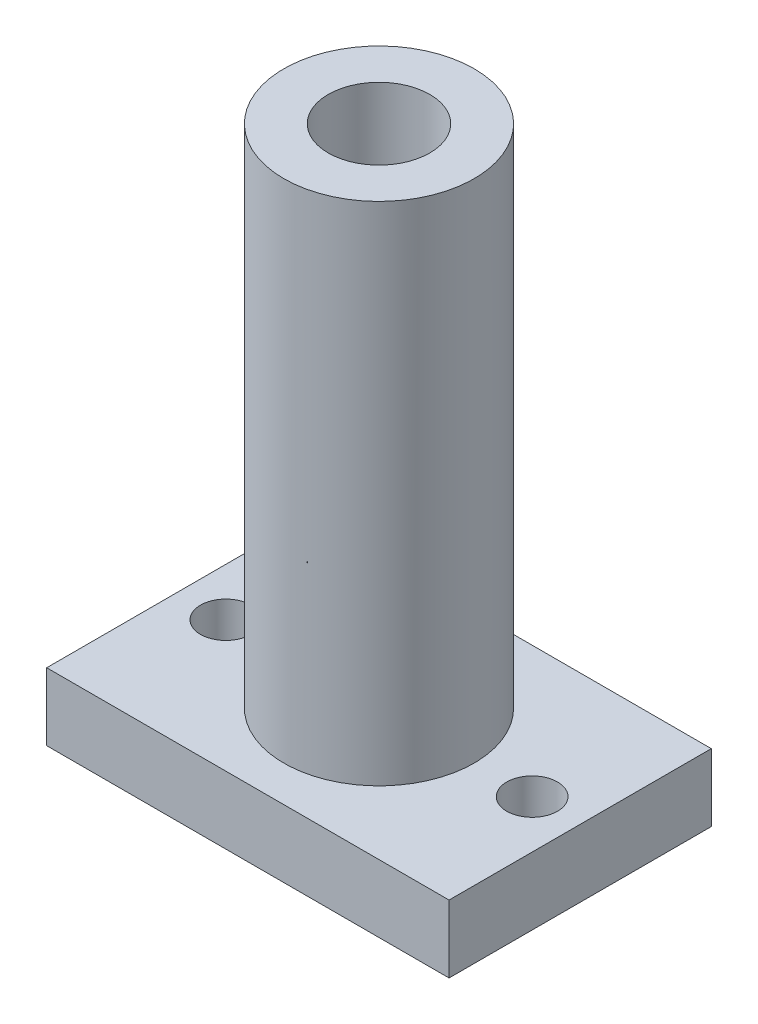
ISO-10303-21;
HEADER;
FILE_DESCRIPTION(('STEP AP214'),'2;1');
FILE_NAME('part.step','',(''),(''),'','','');
FILE_SCHEMA(('AUTOMOTIVE_DESIGN { 1 0 10303 214 1 1 1 1 }'));
ENDSEC;
DATA;
#1=APPLICATION_CONTEXT('core data for automotive mechanical design processes');
#2=APPLICATION_PROTOCOL_DEFINITION('international standard','automotive_design',2000,#1);
#3=PRODUCT_CONTEXT('',#1,'mechanical');
#4=PRODUCT('Part','Part','',(#3));
#5=PRODUCT_RELATED_PRODUCT_CATEGORY('part','',(#4));
#6=PRODUCT_DEFINITION_FORMATION('','',#4);
#7=PRODUCT_DEFINITION_CONTEXT('part definition',#1,'design');
#8=PRODUCT_DEFINITION('design','',#6,#7);
#9=PRODUCT_DEFINITION_SHAPE('','',#8);
#10=(LENGTH_UNIT() NAMED_UNIT(*) SI_UNIT(.MILLI.,.METRE.));
#11=(NAMED_UNIT(*) PLANE_ANGLE_UNIT() SI_UNIT($,.RADIAN.));
#12=(NAMED_UNIT(*) SI_UNIT($,.STERADIAN.) SOLID_ANGLE_UNIT());
#13=UNCERTAINTY_MEASURE_WITH_UNIT(LENGTH_MEASURE(1.E-05),#10,'distance_accuracy_value','');
#14=(GEOMETRIC_REPRESENTATION_CONTEXT(3) GLOBAL_UNCERTAINTY_ASSIGNED_CONTEXT((#13)) GLOBAL_UNIT_ASSIGNED_CONTEXT((#10,
#11,#12)) REPRESENTATION_CONTEXT('',''));
#15=CARTESIAN_POINT('',(0.,0.,0.));
#16=DIRECTION('',(0.,0.,1.));
#17=DIRECTION('',(1.,0.,0.));
#18=AXIS2_PLACEMENT_3D('',#15,#16,#17);
#19=CARTESIAN_POINT('',(0.,5.32,0.));
#20=DIRECTION('',(1.,0.,0.));
#21=DIRECTION('',(0.,0.,-1.));
#22=AXIS2_PLACEMENT_3D('',#19,#20,#21);
#23=PLANE('',#22);
#24=DIRECTION('',(0.,0.,1.));
#25=VECTOR('',#24,1.);
#26=CARTESIAN_POINT('',(0.,0.,0.));
#27=LINE('',#26,#25);
#28=CARTESIAN_POINT('',(0.,0.,-20.66));
#29=VERTEX_POINT('',#28);
#30=CARTESIAN_POINT('',(0.,0.,0.));
#31=VERTEX_POINT('',#30);
#32=EDGE_CURVE('E99',#29,#31,#27,.T.);
#33=ORIENTED_EDGE('',*,*,#32,.T.);
#34=DIRECTION('',(0.,-1.,0.));
#35=VECTOR('',#34,1.);
#36=CARTESIAN_POINT('',(0.,5.32,0.));
#37=LINE('',#36,#35);
#38=CARTESIAN_POINT('',(0.,5.32,0.));
#39=VERTEX_POINT('',#38);
#40=EDGE_CURVE('E41',#39,#31,#37,.T.);
#41=ORIENTED_EDGE('',*,*,#40,.F.);
#42=DIRECTION('',(0.,0.,1.));
#43=VECTOR('',#42,1.);
#44=CARTESIAN_POINT('',(0.,5.32,0.));
#45=LINE('',#44,#43);
#46=CARTESIAN_POINT('',(0.,5.32,-20.66));
#47=VERTEX_POINT('',#46);
#48=EDGE_CURVE('E85',#47,#39,#45,.T.);
#49=ORIENTED_EDGE('',*,*,#48,.F.);
#50=DIRECTION('',(0.,-1.,0.));
#51=VECTOR('',#50,1.);
#52=CARTESIAN_POINT('',(0.,5.32,-20.66));
#53=LINE('',#52,#51);
#54=EDGE_CURVE('E95',#47,#29,#53,.T.);
#55=ORIENTED_EDGE('',*,*,#54,.T.);
#56=EDGE_LOOP('',(#33,#41,#49,#55));
#57=FACE_BOUND('',#56,.T.);
#58=ADVANCED_FACE('F32',(#57),#23,.F.);
#59=CARTESIAN_POINT('',(0.,5.32,0.));
#60=DIRECTION('',(0.,0.,-1.));
#61=DIRECTION('',(-1.,0.,0.));
#62=AXIS2_PLACEMENT_3D('',#59,#60,#61);
#63=PLANE('',#62);
#64=DIRECTION('',(1.,0.,0.));
#65=VECTOR('',#64,1.);
#66=CARTESIAN_POINT('',(0.,0.,0.));
#67=LINE('',#66,#65);
#68=CARTESIAN_POINT('',(31.7,0.,0.));
#69=VERTEX_POINT('',#68);
#70=EDGE_CURVE('E90',#31,#69,#67,.T.);
#71=ORIENTED_EDGE('',*,*,#70,.T.);
#72=DIRECTION('',(0.,-1.,0.));
#73=VECTOR('',#72,1.);
#74=CARTESIAN_POINT('',(31.7,5.32,0.));
#75=LINE('',#74,#73);
#76=CARTESIAN_POINT('',(31.7,5.32,0.));
#77=VERTEX_POINT('',#76);
#78=EDGE_CURVE('E88',#77,#69,#75,.T.);
#79=ORIENTED_EDGE('',*,*,#78,.F.);
#80=DIRECTION('',(1.,0.,0.));
#81=VECTOR('',#80,1.);
#82=CARTESIAN_POINT('',(0.,5.32,0.));
#83=LINE('',#82,#81);
#84=EDGE_CURVE('E80',#39,#77,#83,.T.);
#85=ORIENTED_EDGE('',*,*,#84,.F.);
#86=ORIENTED_EDGE('',*,*,#40,.T.);
#87=EDGE_LOOP('',(#71,#79,#85,#86));
#88=FACE_BOUND('',#87,.T.);
#89=ADVANCED_FACE('F89',(#88),#63,.F.);
#90=CARTESIAN_POINT('',(31.7,5.32,0.));
#91=DIRECTION('',(-1.,0.,0.));
#92=DIRECTION('',(0.,0.,1.));
#93=AXIS2_PLACEMENT_3D('',#90,#91,#92);
#94=PLANE('',#93);
#95=DIRECTION('',(0.,0.,-1.));
#96=VECTOR('',#95,1.);
#97=CARTESIAN_POINT('',(31.7,0.,0.));
#98=LINE('',#97,#96);
#99=CARTESIAN_POINT('',(31.7,0.,-20.66));
#100=VERTEX_POINT('',#99);
#101=EDGE_CURVE('E66',#69,#100,#98,.T.);
#102=ORIENTED_EDGE('',*,*,#101,.T.);
#103=DIRECTION('',(0.,-1.,0.));
#104=VECTOR('',#103,1.);
#105=CARTESIAN_POINT('',(31.7,5.32,-20.66));
#106=LINE('',#105,#104);
#107=CARTESIAN_POINT('',(31.7,5.32,-20.66));
#108=VERTEX_POINT('',#107);
#109=EDGE_CURVE('E91',#108,#100,#106,.T.);
#110=ORIENTED_EDGE('',*,*,#109,.F.);
#111=DIRECTION('',(0.,0.,-1.));
#112=VECTOR('',#111,1.);
#113=CARTESIAN_POINT('',(31.7,5.32,0.));
#114=LINE('',#113,#112);
#115=EDGE_CURVE('E83',#77,#108,#114,.T.);
#116=ORIENTED_EDGE('',*,*,#115,.F.);
#117=ORIENTED_EDGE('',*,*,#78,.T.);
#118=EDGE_LOOP('',(#102,#110,#116,#117));
#119=FACE_BOUND('',#118,.T.);
#120=ADVANCED_FACE('F93',(#119),#94,.F.);
#121=CARTESIAN_POINT('',(0.,5.32,-20.66));
#122=DIRECTION('',(0.,0.,1.));
#123=DIRECTION('',(1.,0.,0.));
#124=AXIS2_PLACEMENT_3D('',#121,#122,#123);
#125=PLANE('',#124);
#126=DIRECTION('',(-1.,0.,0.));
#127=VECTOR('',#126,1.);
#128=CARTESIAN_POINT('',(0.,0.,-20.66));
#129=LINE('',#128,#127);
#130=EDGE_CURVE('E72',#100,#29,#129,.T.);
#131=ORIENTED_EDGE('',*,*,#130,.T.);
#132=ORIENTED_EDGE('',*,*,#54,.F.);
#133=DIRECTION('',(-1.,0.,0.));
#134=VECTOR('',#133,1.);
#135=CARTESIAN_POINT('',(0.,5.32,-20.66));
#136=LINE('',#135,#134);
#137=EDGE_CURVE('E49',#108,#47,#136,.T.);
#138=ORIENTED_EDGE('',*,*,#137,.F.);
#139=ORIENTED_EDGE('',*,*,#109,.T.);
#140=EDGE_LOOP('',(#131,#132,#138,#139));
#141=FACE_BOUND('',#140,.T.);
#142=ADVANCED_FACE('F123',(#141),#125,.F.);
#143=CARTESIAN_POINT('',(0.,5.32,0.));
#144=DIRECTION('',(0.,-1.,0.));
#145=DIRECTION('',(0.,0.,-1.));
#146=AXIS2_PLACEMENT_3D('',#143,#144,#145);
#147=PLANE('',#146);
#148=CARTESIAN_POINT('',(15.85,5.32,-10.33));
#149=DIRECTION('',(0.,-1.,0.));
#150=DIRECTION('',(0.,0.,-1.));
#151=AXIS2_PLACEMENT_3D('',#148,#149,#150);
#152=CIRCLE('',#151,7.5);
#153=CARTESIAN_POINT('',(15.85,5.32,-17.83));
#154=VERTEX_POINT('',#153);
#155=EDGE_CURVE('E11',#154,#154,#152,.F.);
#156=ORIENTED_EDGE('',*,*,#155,.F.);
#157=EDGE_LOOP('',(#156));
#158=FACE_BOUND('',#157,.T.);
#159=CARTESIAN_POINT('',(3.785,5.32,-10.33));
#160=DIRECTION('',(0.,1.,0.));
#161=DIRECTION('',(0.,0.,1.));
#162=AXIS2_PLACEMENT_3D('',#159,#160,#161);
#163=CIRCLE('',#162,2.);
#164=CARTESIAN_POINT('',(3.785,5.32,-8.33));
#165=VERTEX_POINT('',#164);
#166=EDGE_CURVE('E203',#165,#165,#163,.T.);
#167=ORIENTED_EDGE('',*,*,#166,.F.);
#168=EDGE_LOOP('',(#167));
#169=FACE_BOUND('',#168,.T.);
#170=CARTESIAN_POINT('',(27.915,5.32,-10.33));
#171=DIRECTION('',(0.,1.,0.));
#172=DIRECTION('',(0.,0.,1.));
#173=AXIS2_PLACEMENT_3D('',#170,#171,#172);
#174=CIRCLE('',#173,2.);
#175=CARTESIAN_POINT('',(27.915,5.32,-8.33));
#176=VERTEX_POINT('',#175);
#177=EDGE_CURVE('E209',#176,#176,#174,.T.);
#178=ORIENTED_EDGE('',*,*,#177,.F.);
#179=EDGE_LOOP('',(#178));
#180=FACE_BOUND('',#179,.T.);
#181=ORIENTED_EDGE('',*,*,#48,.T.);
#182=ORIENTED_EDGE('',*,*,#84,.T.);
#183=ORIENTED_EDGE('',*,*,#115,.T.);
#184=ORIENTED_EDGE('',*,*,#137,.T.);
#185=EDGE_LOOP('',(#181,#182,#183,#184));
#186=FACE_BOUND('',#185,.T.);
#187=ADVANCED_FACE('F81',(#158,#169,#180,#186),#147,.F.);
#188=CARTESIAN_POINT('',(0.,0.,0.));
#189=DIRECTION('',(0.,-1.,0.));
#190=DIRECTION('',(0.,0.,-1.));
#191=AXIS2_PLACEMENT_3D('',#188,#189,#190);
#192=PLANE('',#191);
#193=CARTESIAN_POINT('',(15.85,0.,-10.33));
#194=DIRECTION('',(0.,-1.,0.));
#195=DIRECTION('',(0.,0.,-1.));
#196=AXIS2_PLACEMENT_3D('',#193,#194,#195);
#197=CIRCLE('',#196,4.);
#198=CARTESIAN_POINT('',(15.85,0.,-14.33));
#199=VERTEX_POINT('',#198);
#200=EDGE_CURVE('E35',#199,#199,#197,.T.);
#201=ORIENTED_EDGE('',*,*,#200,.F.);
#202=EDGE_LOOP('',(#201));
#203=FACE_BOUND('',#202,.T.);
#204=CARTESIAN_POINT('',(3.785,0.,-10.33));
#205=DIRECTION('',(0.,1.,0.));
#206=DIRECTION('',(0.,0.,1.));
#207=AXIS2_PLACEMENT_3D('',#204,#205,#206);
#208=CIRCLE('',#207,2.);
#209=CARTESIAN_POINT('',(3.785,0.,-8.33));
#210=VERTEX_POINT('',#209);
#211=EDGE_CURVE('E102',#210,#210,#208,.T.);
#212=ORIENTED_EDGE('',*,*,#211,.T.);
#213=EDGE_LOOP('',(#212));
#214=FACE_BOUND('',#213,.T.);
#215=CARTESIAN_POINT('',(27.915,0.,-10.33));
#216=DIRECTION('',(0.,1.,0.));
#217=DIRECTION('',(0.,0.,1.));
#218=AXIS2_PLACEMENT_3D('',#215,#216,#217);
#219=CIRCLE('',#218,2.);
#220=CARTESIAN_POINT('',(27.915,0.,-8.33));
#221=VERTEX_POINT('',#220);
#222=EDGE_CURVE('E205',#221,#221,#219,.T.);
#223=ORIENTED_EDGE('',*,*,#222,.T.);
#224=EDGE_LOOP('',(#223));
#225=FACE_BOUND('',#224,.T.);
#226=ORIENTED_EDGE('',*,*,#32,.F.);
#227=ORIENTED_EDGE('',*,*,#130,.F.);
#228=ORIENTED_EDGE('',*,*,#101,.F.);
#229=ORIENTED_EDGE('',*,*,#70,.F.);
#230=EDGE_LOOP('',(#226,#227,#228,#229));
#231=FACE_BOUND('',#230,.T.);
#232=ADVANCED_FACE('F111',(#203,#214,#225,#231),#192,.T.);
#233=CARTESIAN_POINT('',(27.915,0.,-10.33));
#234=DIRECTION('',(0.,1.,0.));
#235=DIRECTION('',(0.,0.,1.));
#236=AXIS2_PLACEMENT_3D('',#233,#234,#235);
#237=CYLINDRICAL_SURFACE('',#236,2.);
#238=ORIENTED_EDGE('',*,*,#222,.F.);
#239=EDGE_LOOP('',(#238));
#240=FACE_BOUND('',#239,.T.);
#241=ORIENTED_EDGE('',*,*,#177,.T.);
#242=EDGE_LOOP('',(#241));
#243=FACE_BOUND('',#242,.T.);
#244=ADVANCED_FACE('F113',(#240,#243),#237,.F.);
#245=CARTESIAN_POINT('',(3.785,0.,-10.33));
#246=DIRECTION('',(0.,1.,0.));
#247=DIRECTION('',(0.,0.,1.));
#248=AXIS2_PLACEMENT_3D('',#245,#246,#247);
#249=CYLINDRICAL_SURFACE('',#248,2.);
#250=ORIENTED_EDGE('',*,*,#211,.F.);
#251=EDGE_LOOP('',(#250));
#252=FACE_BOUND('',#251,.T.);
#253=ORIENTED_EDGE('',*,*,#166,.T.);
#254=EDGE_LOOP('',(#253));
#255=FACE_BOUND('',#254,.T.);
#256=ADVANCED_FACE('F120',(#252,#255),#249,.F.);
#257=CARTESIAN_POINT('',(15.85,45.2,-10.33));
#258=DIRECTION('',(0.,1.,0.));
#259=DIRECTION('',(0.,0.,1.));
#260=AXIS2_PLACEMENT_3D('',#257,#258,#259);
#261=PLANE('',#260);
#262=CARTESIAN_POINT('',(15.85,45.2,-10.33));
#263=DIRECTION('',(0.,1.,0.));
#264=DIRECTION('',(0.,0.,1.));
#265=AXIS2_PLACEMENT_3D('',#262,#263,#264);
#266=CIRCLE('',#265,7.5);
#267=CARTESIAN_POINT('',(15.85,45.2,-2.83));
#268=VERTEX_POINT('',#267);
#269=EDGE_CURVE('E214',#268,#268,#266,.T.);
#270=ORIENTED_EDGE('',*,*,#269,.T.);
#271=EDGE_LOOP('',(#270));
#272=FACE_BOUND('',#271,.T.);
#273=CARTESIAN_POINT('',(15.85,45.2,-10.33));
#274=DIRECTION('',(0.,1.,0.));
#275=DIRECTION('',(0.,0.,1.));
#276=AXIS2_PLACEMENT_3D('',#273,#274,#275);
#277=CIRCLE('',#276,4.);
#278=CARTESIAN_POINT('',(15.85,45.2,-6.33));
#279=VERTEX_POINT('',#278);
#280=EDGE_CURVE('E218',#279,#279,#277,.T.);
#281=ORIENTED_EDGE('',*,*,#280,.F.);
#282=EDGE_LOOP('',(#281));
#283=FACE_BOUND('',#282,.T.);
#284=ADVANCED_FACE('F157',(#272,#283),#261,.T.);
#285=CARTESIAN_POINT('',(15.85,45.2,-10.33));
#286=DIRECTION('',(0.,-1.,0.));
#287=DIRECTION('',(0.,0.,-1.));
#288=AXIS2_PLACEMENT_3D('',#285,#286,#287);
#289=CYLINDRICAL_SURFACE('',#288,7.5);
#290=ORIENTED_EDGE('',*,*,#269,.F.);
#291=EDGE_LOOP('',(#290));
#292=FACE_BOUND('',#291,.T.);
#293=ORIENTED_EDGE('',*,*,#155,.T.);
#294=EDGE_LOOP('',(#293));
#295=FACE_BOUND('',#294,.T.);
#296=ADVANCED_FACE('F162',(#292,#295),#289,.T.);
#297=CARTESIAN_POINT('',(15.85,45.2,-10.33));
#298=DIRECTION('',(0.,-1.,0.));
#299=DIRECTION('',(0.,0.,-1.));
#300=AXIS2_PLACEMENT_3D('',#297,#298,#299);
#301=CYLINDRICAL_SURFACE('',#300,4.);
#302=ORIENTED_EDGE('',*,*,#280,.T.);
#303=EDGE_LOOP('',(#302));
#304=FACE_BOUND('',#303,.T.);
#305=ORIENTED_EDGE('',*,*,#200,.T.);
#306=EDGE_LOOP('',(#305));
#307=FACE_BOUND('',#306,.T.);
#308=ADVANCED_FACE('F171',(#304,#307),#301,.F.);
#309=CLOSED_SHELL('',(#58,#89,#120,#142,#187,#232,#244,#256,#284,#296,#308));
#310=MANIFOLD_SOLID_BREP('B2',#309);
#311=ADVANCED_BREP_SHAPE_REPRESENTATION('',(#18,#310),#14);
#312=SHAPE_DEFINITION_REPRESENTATION(#9,#311);
ENDSEC;
END-ISO-10303-21;
